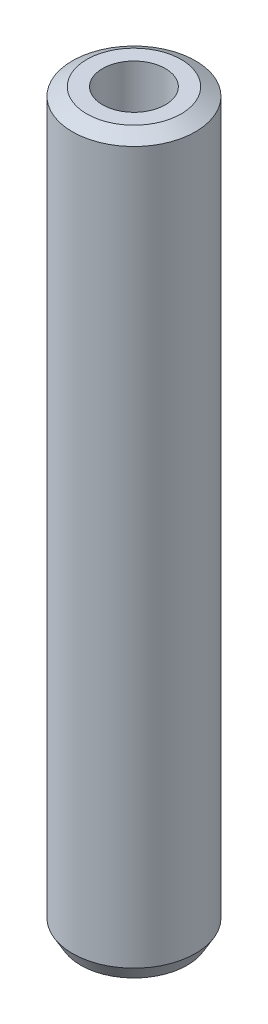
ISO-10303-21;
HEADER;
FILE_DESCRIPTION(('STEP AP214'),'2;1');
FILE_NAME('part.step','',(''),(''),'','','');
FILE_SCHEMA(('AUTOMOTIVE_DESIGN { 1 0 10303 214 1 1 1 1 }'));
ENDSEC;
DATA;
#1=APPLICATION_CONTEXT('core data for automotive mechanical design processes');
#2=APPLICATION_PROTOCOL_DEFINITION('international standard','automotive_design',2000,#1);
#3=PRODUCT_CONTEXT('',#1,'mechanical');
#4=PRODUCT('Part','Part','',(#3));
#5=PRODUCT_RELATED_PRODUCT_CATEGORY('part','',(#4));
#6=PRODUCT_DEFINITION_FORMATION('','',#4);
#7=PRODUCT_DEFINITION_CONTEXT('part definition',#1,'design');
#8=PRODUCT_DEFINITION('design','',#6,#7);
#9=PRODUCT_DEFINITION_SHAPE('','',#8);
#10=(LENGTH_UNIT() NAMED_UNIT(*) SI_UNIT(.MILLI.,.METRE.));
#11=(NAMED_UNIT(*) PLANE_ANGLE_UNIT() SI_UNIT($,.RADIAN.));
#12=(NAMED_UNIT(*) SI_UNIT($,.STERADIAN.) SOLID_ANGLE_UNIT());
#13=UNCERTAINTY_MEASURE_WITH_UNIT(LENGTH_MEASURE(1.E-05),#10,'distance_accuracy_value','');
#14=(GEOMETRIC_REPRESENTATION_CONTEXT(3) GLOBAL_UNCERTAINTY_ASSIGNED_CONTEXT((#13)) GLOBAL_UNIT_ASSIGNED_CONTEXT((#10,
#11,#12)) REPRESENTATION_CONTEXT('',''));
#15=CARTESIAN_POINT('',(0.,0.,0.));
#16=DIRECTION('',(0.,0.,1.));
#17=DIRECTION('',(1.,0.,0.));
#18=AXIS2_PLACEMENT_3D('',#15,#16,#17);
#19=CARTESIAN_POINT('',(0.,357.825130062882,0.));
#20=DIRECTION('',(0.,-1.,0.));
#21=DIRECTION('',(0.,0.,-1.));
#22=AXIS2_PLACEMENT_3D('',#19,#20,#21);
#23=CYLINDRICAL_SURFACE('',#22,30.);
#24=CARTESIAN_POINT('',(0.,353.782145548332,0.));
#25=DIRECTION('',(0.,1.,0.));
#26=DIRECTION('',(0.,0.,1.));
#27=AXIS2_PLACEMENT_3D('',#24,#25,#26);
#28=CIRCLE('',#27,30.);
#29=CARTESIAN_POINT('',(0.,353.782145548332,30.));
#30=VERTEX_POINT('',#29);
#31=EDGE_CURVE('E50',#30,#30,#28,.F.);
#32=ORIENTED_EDGE('',*,*,#31,.T.);
#33=EDGE_LOOP('',(#32));
#34=FACE_BOUND('',#33,.T.);
#35=CARTESIAN_POINT('',(0.,7.00265459341504,0.));
#36=DIRECTION('',(0.,1.,0.));
#37=DIRECTION('',(0.,0.,1.));
#38=AXIS2_PLACEMENT_3D('',#35,#36,#37);
#39=CIRCLE('',#38,30.);
#40=CARTESIAN_POINT('',(0.,7.00265459341504,30.));
#41=VERTEX_POINT('',#40);
#42=EDGE_CURVE('E51',#41,#41,#39,.T.);
#43=ORIENTED_EDGE('',*,*,#42,.T.);
#44=EDGE_LOOP('',(#43));
#45=FACE_BOUND('',#44,.T.);
#46=ADVANCED_FACE('F39',(#34,#45),#23,.T.);
#47=CARTESIAN_POINT('',(0.,357.825130062882,0.));
#48=DIRECTION('',(0.,1.,0.));
#49=DIRECTION('',(0.,0.,1.));
#50=AXIS2_PLACEMENT_3D('',#47,#48,#49);
#51=PLANE('',#50);
#52=CARTESIAN_POINT('',(0.,357.825130062882,0.));
#53=DIRECTION('',(0.,1.,0.));
#54=DIRECTION('',(0.,0.,1.));
#55=AXIS2_PLACEMENT_3D('',#52,#53,#54);
#56=CIRCLE('',#55,22.9973454065848);
#57=CARTESIAN_POINT('',(0.,357.825130062882,22.9973454065848));
#58=VERTEX_POINT('',#57);
#59=EDGE_CURVE('E54',#58,#58,#56,.T.);
#60=ORIENTED_EDGE('',*,*,#59,.T.);
#61=EDGE_LOOP('',(#60));
#62=FACE_BOUND('',#61,.T.);
#63=CARTESIAN_POINT('',(0.,357.825130062882,0.));
#64=DIRECTION('',(0.,1.,0.));
#65=DIRECTION('',(0.,0.,1.));
#66=AXIS2_PLACEMENT_3D('',#63,#64,#65);
#67=CIRCLE('',#66,15.3156375084349);
#68=CARTESIAN_POINT('',(0.,357.825130062882,15.3156375084349));
#69=VERTEX_POINT('',#68);
#70=EDGE_CURVE('E58',#69,#69,#67,.T.);
#71=ORIENTED_EDGE('',*,*,#70,.F.);
#72=EDGE_LOOP('',(#71));
#73=FACE_BOUND('',#72,.T.);
#74=ADVANCED_FACE('F69',(#62,#73),#51,.T.);
#75=CARTESIAN_POINT('',(0.,0.,0.));
#76=DIRECTION('',(0.,1.,0.));
#77=DIRECTION('',(0.,0.,1.));
#78=AXIS2_PLACEMENT_3D('',#75,#76,#77);
#79=PLANE('',#78);
#80=CARTESIAN_POINT('',(0.,0.,0.));
#81=DIRECTION('',(0.,1.,0.));
#82=DIRECTION('',(0.,0.,1.));
#83=AXIS2_PLACEMENT_3D('',#80,#81,#82);
#84=CIRCLE('',#83,25.9570154854498);
#85=CARTESIAN_POINT('',(0.,0.,25.9570154854498));
#86=VERTEX_POINT('',#85);
#87=EDGE_CURVE('E10',#86,#86,#84,.F.);
#88=ORIENTED_EDGE('',*,*,#87,.T.);
#89=EDGE_LOOP('',(#88));
#90=FACE_BOUND('',#89,.T.);
#91=CARTESIAN_POINT('',(0.,0.,0.));
#92=DIRECTION('',(0.,1.,0.));
#93=DIRECTION('',(0.,0.,1.));
#94=AXIS2_PLACEMENT_3D('',#91,#92,#93);
#95=CIRCLE('',#94,15.3156375084349);
#96=CARTESIAN_POINT('',(0.,0.,15.3156375084349));
#97=VERTEX_POINT('',#96);
#98=EDGE_CURVE('E63',#97,#97,#95,.T.);
#99=ORIENTED_EDGE('',*,*,#98,.T.);
#100=EDGE_LOOP('',(#99));
#101=FACE_BOUND('',#100,.T.);
#102=ADVANCED_FACE('F75',(#90,#101),#79,.F.);
#103=CARTESIAN_POINT('',(0.,357.825130062882,0.));
#104=DIRECTION('',(0.,-1.,0.));
#105=DIRECTION('',(0.,0.,-1.));
#106=AXIS2_PLACEMENT_3D('',#103,#104,#105);
#107=CYLINDRICAL_SURFACE('',#106,15.3156375084349);
#108=ORIENTED_EDGE('',*,*,#70,.T.);
#109=EDGE_LOOP('',(#108));
#110=FACE_BOUND('',#109,.T.);
#111=ORIENTED_EDGE('',*,*,#98,.F.);
#112=EDGE_LOOP('',(#111));
#113=FACE_BOUND('',#112,.T.);
#114=ADVANCED_FACE('F70',(#110,#113),#107,.F.);
#115=CARTESIAN_POINT('',(0.,357.825130062882,0.));
#116=DIRECTION('',(0.,-1.,0.));
#117=DIRECTION('',(0.,0.,-1.));
#118=AXIS2_PLACEMENT_3D('',#115,#116,#117);
#119=CONICAL_SURFACE('',#118,22.9973454065848,1.04719755119659);
#120=ORIENTED_EDGE('',*,*,#31,.F.);
#121=EDGE_LOOP('',(#120));
#122=FACE_BOUND('',#121,.T.);
#123=ORIENTED_EDGE('',*,*,#59,.F.);
#124=EDGE_LOOP('',(#123));
#125=FACE_BOUND('',#124,.T.);
#126=ADVANCED_FACE('F81',(#122,#125),#119,.T.);
#127=CARTESIAN_POINT('',(0.,7.00265459341504,0.));
#128=DIRECTION('',(0.,1.,0.));
#129=DIRECTION('',(0.,0.,1.));
#130=AXIS2_PLACEMENT_3D('',#127,#128,#129);
#131=CONICAL_SURFACE('',#130,30.,0.5235987755983);
#132=ORIENTED_EDGE('',*,*,#87,.F.);
#133=EDGE_LOOP('',(#132));
#134=FACE_BOUND('',#133,.T.);
#135=ORIENTED_EDGE('',*,*,#42,.F.);
#136=EDGE_LOOP('',(#135));
#137=FACE_BOUND('',#136,.T.);
#138=ADVANCED_FACE('F45',(#134,#137),#131,.T.);
#139=CLOSED_SHELL('',(#46,#74,#102,#114,#126,#138));
#140=MANIFOLD_SOLID_BREP('B2',#139);
#141=ADVANCED_BREP_SHAPE_REPRESENTATION('',(#18,#140),#14);
#142=SHAPE_DEFINITION_REPRESENTATION(#9,#141);
ENDSEC;
END-ISO-10303-21;
